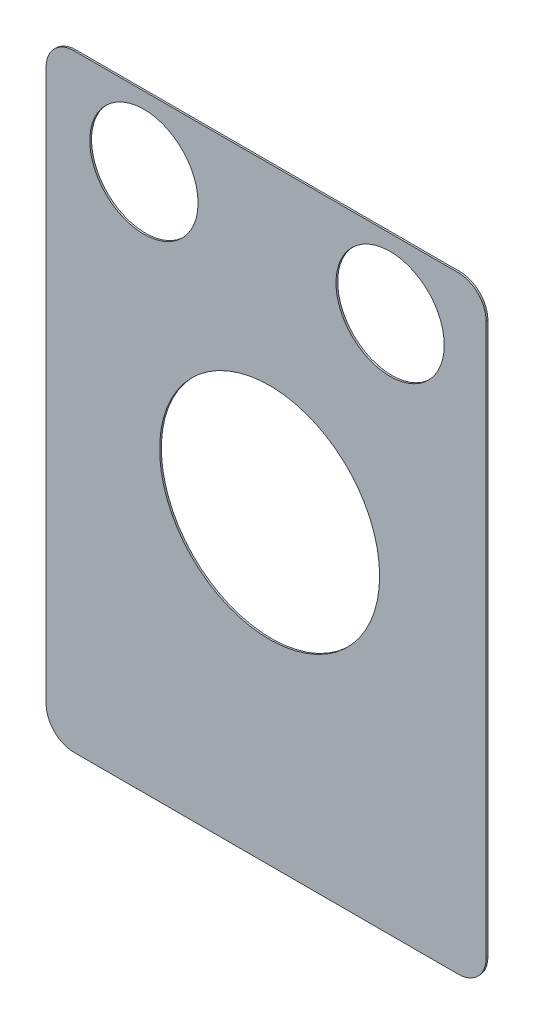
ISO-10303-21;
HEADER;
FILE_DESCRIPTION(('STEP AP214'),'2;1');
FILE_NAME('part.step','',(''),(''),'','','');
FILE_SCHEMA(('AUTOMOTIVE_DESIGN { 1 0 10303 214 1 1 1 1 }'));
ENDSEC;
DATA;
#1=APPLICATION_CONTEXT('core data for automotive mechanical design processes');
#2=APPLICATION_PROTOCOL_DEFINITION('international standard','automotive_design',2000,#1);
#3=PRODUCT_CONTEXT('',#1,'mechanical');
#4=PRODUCT('Part','Part','',(#3));
#5=PRODUCT_RELATED_PRODUCT_CATEGORY('part','',(#4));
#6=PRODUCT_DEFINITION_FORMATION('','',#4);
#7=PRODUCT_DEFINITION_CONTEXT('part definition',#1,'design');
#8=PRODUCT_DEFINITION('design','',#6,#7);
#9=PRODUCT_DEFINITION_SHAPE('','',#8);
#10=(LENGTH_UNIT() NAMED_UNIT(*) SI_UNIT(.MILLI.,.METRE.));
#11=(NAMED_UNIT(*) PLANE_ANGLE_UNIT() SI_UNIT($,.RADIAN.));
#12=(NAMED_UNIT(*) SI_UNIT($,.STERADIAN.) SOLID_ANGLE_UNIT());
#13=UNCERTAINTY_MEASURE_WITH_UNIT(LENGTH_MEASURE(1.E-05),#10,'distance_accuracy_value','');
#14=(GEOMETRIC_REPRESENTATION_CONTEXT(3) GLOBAL_UNCERTAINTY_ASSIGNED_CONTEXT((#13)) GLOBAL_UNIT_ASSIGNED_CONTEXT((#10,
#11,#12)) REPRESENTATION_CONTEXT('',''));
#15=CARTESIAN_POINT('',(0.,0.,0.));
#16=DIRECTION('',(0.,0.,1.));
#17=DIRECTION('',(1.,0.,0.));
#18=AXIS2_PLACEMENT_3D('',#15,#16,#17);
#19=CARTESIAN_POINT('',(-27.94,-40.132,-0.254));
#20=DIRECTION('',(0.,0.,1.));
#21=DIRECTION('',(1.,0.,0.));
#22=AXIS2_PLACEMENT_3D('',#19,#20,#21);
#23=CYLINDRICAL_SURFACE('',#22,4.064);
#24=CARTESIAN_POINT('',(-27.94,-40.132,0.));
#25=DIRECTION('',(0.,0.,1.));
#26=DIRECTION('',(1.,0.,0.));
#27=AXIS2_PLACEMENT_3D('',#24,#25,#26);
#28=CIRCLE('',#27,4.064);
#29=CARTESIAN_POINT('',(-32.004,-40.132,0.));
#30=VERTEX_POINT('',#29);
#31=CARTESIAN_POINT('',(-27.94,-44.196,0.));
#32=VERTEX_POINT('',#31);
#33=EDGE_CURVE('E135',#30,#32,#28,.T.);
#34=ORIENTED_EDGE('',*,*,#33,.F.);
#35=DIRECTION('',(0.,0.,1.));
#36=VECTOR('',#35,1.);
#37=CARTESIAN_POINT('',(-32.004,-40.132,-0.254));
#38=LINE('',#37,#36);
#39=CARTESIAN_POINT('',(-32.004,-40.132,-0.254));
#40=VERTEX_POINT('',#39);
#41=EDGE_CURVE('E11',#40,#30,#38,.T.);
#42=ORIENTED_EDGE('',*,*,#41,.F.);
#43=CARTESIAN_POINT('',(-27.94,-40.132,-0.254));
#44=DIRECTION('',(0.,0.,1.));
#45=DIRECTION('',(1.,0.,0.));
#46=AXIS2_PLACEMENT_3D('',#43,#44,#45);
#47=CIRCLE('',#46,4.064);
#48=CARTESIAN_POINT('',(-27.94,-44.196,-0.254));
#49=VERTEX_POINT('',#48);
#50=EDGE_CURVE('E156',#40,#49,#47,.T.);
#51=ORIENTED_EDGE('',*,*,#50,.T.);
#52=DIRECTION('',(0.,0.,1.));
#53=VECTOR('',#52,1.);
#54=CARTESIAN_POINT('',(-27.94,-44.196,-0.254));
#55=LINE('',#54,#53);
#56=EDGE_CURVE('E41',#49,#32,#55,.T.);
#57=ORIENTED_EDGE('',*,*,#56,.T.);
#58=EDGE_LOOP('',(#34,#42,#51,#57));
#59=FACE_BOUND('',#58,.T.);
#60=ADVANCED_FACE('F38',(#59),#23,.T.);
#61=CARTESIAN_POINT('',(-32.004,-40.132,-0.254));
#62=DIRECTION('',(-1.,0.,0.));
#63=DIRECTION('',(0.,0.,1.));
#64=AXIS2_PLACEMENT_3D('',#61,#62,#63);
#65=PLANE('',#64);
#66=DIRECTION('',(0.,-1.,0.));
#67=VECTOR('',#66,1.);
#68=CARTESIAN_POINT('',(-32.004,-40.132,0.));
#69=LINE('',#68,#67);
#70=CARTESIAN_POINT('',(-32.004,40.132,0.));
#71=VERTEX_POINT('',#70);
#72=EDGE_CURVE('E154',#71,#30,#69,.T.);
#73=ORIENTED_EDGE('',*,*,#72,.F.);
#74=DIRECTION('',(0.,0.,1.));
#75=VECTOR('',#74,1.);
#76=CARTESIAN_POINT('',(-32.004,40.132,-0.254));
#77=LINE('',#76,#75);
#78=CARTESIAN_POINT('',(-32.004,40.132,-0.254));
#79=VERTEX_POINT('',#78);
#80=EDGE_CURVE('E47',#79,#71,#77,.T.);
#81=ORIENTED_EDGE('',*,*,#80,.F.);
#82=DIRECTION('',(0.,-1.,0.));
#83=VECTOR('',#82,1.);
#84=CARTESIAN_POINT('',(-32.004,-40.132,-0.254));
#85=LINE('',#84,#83);
#86=EDGE_CURVE('E125',#79,#40,#85,.T.);
#87=ORIENTED_EDGE('',*,*,#86,.T.);
#88=ORIENTED_EDGE('',*,*,#41,.T.);
#89=EDGE_LOOP('',(#73,#81,#87,#88));
#90=FACE_BOUND('',#89,.T.);
#91=ADVANCED_FACE('F168',(#90),#65,.T.);
#92=CARTESIAN_POINT('',(-27.94,40.132,-0.254));
#93=DIRECTION('',(0.,0.,1.));
#94=DIRECTION('',(1.,0.,0.));
#95=AXIS2_PLACEMENT_3D('',#92,#93,#94);
#96=CYLINDRICAL_SURFACE('',#95,4.064);
#97=CARTESIAN_POINT('',(-27.94,40.132,0.));
#98=DIRECTION('',(0.,0.,1.));
#99=DIRECTION('',(1.,0.,0.));
#100=AXIS2_PLACEMENT_3D('',#97,#98,#99);
#101=CIRCLE('',#100,4.064);
#102=CARTESIAN_POINT('',(-27.94,44.196,0.));
#103=VERTEX_POINT('',#102);
#104=EDGE_CURVE('E112',#103,#71,#101,.T.);
#105=ORIENTED_EDGE('',*,*,#104,.F.);
#106=DIRECTION('',(0.,0.,1.));
#107=VECTOR('',#106,1.);
#108=CARTESIAN_POINT('',(-27.94,44.196,-0.254));
#109=LINE('',#108,#107);
#110=CARTESIAN_POINT('',(-27.94,44.196,-0.254));
#111=VERTEX_POINT('',#110);
#112=EDGE_CURVE('E107',#111,#103,#109,.T.);
#113=ORIENTED_EDGE('',*,*,#112,.F.);
#114=CARTESIAN_POINT('',(-27.94,40.132,-0.254));
#115=DIRECTION('',(0.,0.,1.));
#116=DIRECTION('',(1.,0.,0.));
#117=AXIS2_PLACEMENT_3D('',#114,#115,#116);
#118=CIRCLE('',#117,4.064);
#119=EDGE_CURVE('E110',#111,#79,#118,.T.);
#120=ORIENTED_EDGE('',*,*,#119,.T.);
#121=ORIENTED_EDGE('',*,*,#80,.T.);
#122=EDGE_LOOP('',(#105,#113,#120,#121));
#123=FACE_BOUND('',#122,.T.);
#124=ADVANCED_FACE('F109',(#123),#96,.T.);
#125=CARTESIAN_POINT('',(-27.94,44.196,-0.254));
#126=DIRECTION('',(0.,1.,0.));
#127=DIRECTION('',(0.,0.,1.));
#128=AXIS2_PLACEMENT_3D('',#125,#126,#127);
#129=PLANE('',#128);
#130=DIRECTION('',(-1.,0.,0.));
#131=VECTOR('',#130,1.);
#132=CARTESIAN_POINT('',(-27.94,44.196,0.));
#133=LINE('',#132,#131);
#134=CARTESIAN_POINT('',(27.94,44.196,0.));
#135=VERTEX_POINT('',#134);
#136=EDGE_CURVE('E151',#135,#103,#133,.T.);
#137=ORIENTED_EDGE('',*,*,#136,.F.);
#138=DIRECTION('',(0.,0.,1.));
#139=VECTOR('',#138,1.);
#140=CARTESIAN_POINT('',(27.94,44.196,-0.254));
#141=LINE('',#140,#139);
#142=CARTESIAN_POINT('',(27.94,44.196,-0.254));
#143=VERTEX_POINT('',#142);
#144=EDGE_CURVE('E117',#143,#135,#141,.T.);
#145=ORIENTED_EDGE('',*,*,#144,.F.);
#146=DIRECTION('',(-1.,0.,0.));
#147=VECTOR('',#146,1.);
#148=CARTESIAN_POINT('',(-27.94,44.196,-0.254));
#149=LINE('',#148,#147);
#150=EDGE_CURVE('E123',#143,#111,#149,.T.);
#151=ORIENTED_EDGE('',*,*,#150,.T.);
#152=ORIENTED_EDGE('',*,*,#112,.T.);
#153=EDGE_LOOP('',(#137,#145,#151,#152));
#154=FACE_BOUND('',#153,.T.);
#155=ADVANCED_FACE('F127',(#154),#129,.T.);
#156=CARTESIAN_POINT('',(27.94,40.132,-0.254));
#157=DIRECTION('',(0.,0.,1.));
#158=DIRECTION('',(1.,0.,0.));
#159=AXIS2_PLACEMENT_3D('',#156,#157,#158);
#160=CYLINDRICAL_SURFACE('',#159,4.064);
#161=CARTESIAN_POINT('',(27.94,40.132,0.));
#162=DIRECTION('',(0.,0.,1.));
#163=DIRECTION('',(1.,0.,0.));
#164=AXIS2_PLACEMENT_3D('',#161,#162,#163);
#165=CIRCLE('',#164,4.064);
#166=CARTESIAN_POINT('',(32.004,40.132,0.));
#167=VERTEX_POINT('',#166);
#168=EDGE_CURVE('E148',#167,#135,#165,.T.);
#169=ORIENTED_EDGE('',*,*,#168,.F.);
#170=DIRECTION('',(0.,0.,1.));
#171=VECTOR('',#170,1.);
#172=CARTESIAN_POINT('',(32.004,40.132,-0.254));
#173=LINE('',#172,#171);
#174=CARTESIAN_POINT('',(32.004,40.132,-0.254));
#175=VERTEX_POINT('',#174);
#176=EDGE_CURVE('E160',#175,#167,#173,.T.);
#177=ORIENTED_EDGE('',*,*,#176,.F.);
#178=CARTESIAN_POINT('',(27.94,40.132,-0.254));
#179=DIRECTION('',(0.,0.,1.));
#180=DIRECTION('',(1.,0.,0.));
#181=AXIS2_PLACEMENT_3D('',#178,#179,#180);
#182=CIRCLE('',#181,4.064);
#183=EDGE_CURVE('E128',#175,#143,#182,.T.);
#184=ORIENTED_EDGE('',*,*,#183,.T.);
#185=ORIENTED_EDGE('',*,*,#144,.T.);
#186=EDGE_LOOP('',(#169,#177,#184,#185));
#187=FACE_BOUND('',#186,.T.);
#188=ADVANCED_FACE('F181',(#187),#160,.T.);
#189=CARTESIAN_POINT('',(32.004,-40.132,-0.254));
#190=DIRECTION('',(1.,0.,0.));
#191=DIRECTION('',(0.,0.,-1.));
#192=AXIS2_PLACEMENT_3D('',#189,#190,#191);
#193=PLANE('',#192);
#194=DIRECTION('',(0.,1.,0.));
#195=VECTOR('',#194,1.);
#196=CARTESIAN_POINT('',(32.004,-40.132,0.));
#197=LINE('',#196,#195);
#198=CARTESIAN_POINT('',(32.004,-40.132,0.));
#199=VERTEX_POINT('',#198);
#200=EDGE_CURVE('E145',#199,#167,#197,.T.);
#201=ORIENTED_EDGE('',*,*,#200,.F.);
#202=DIRECTION('',(0.,0.,1.));
#203=VECTOR('',#202,1.);
#204=CARTESIAN_POINT('',(32.004,-40.132,-0.254));
#205=LINE('',#204,#203);
#206=CARTESIAN_POINT('',(32.004,-40.132,-0.254));
#207=VERTEX_POINT('',#206);
#208=EDGE_CURVE('E162',#207,#199,#205,.T.);
#209=ORIENTED_EDGE('',*,*,#208,.F.);
#210=DIRECTION('',(0.,1.,0.));
#211=VECTOR('',#210,1.);
#212=CARTESIAN_POINT('',(32.004,-40.132,-0.254));
#213=LINE('',#212,#211);
#214=EDGE_CURVE('E130',#207,#175,#213,.T.);
#215=ORIENTED_EDGE('',*,*,#214,.T.);
#216=ORIENTED_EDGE('',*,*,#176,.T.);
#217=EDGE_LOOP('',(#201,#209,#215,#216));
#218=FACE_BOUND('',#217,.T.);
#219=ADVANCED_FACE('F184',(#218),#193,.T.);
#220=CARTESIAN_POINT('',(27.94,-40.132,-0.254));
#221=DIRECTION('',(0.,0.,1.));
#222=DIRECTION('',(1.,0.,0.));
#223=AXIS2_PLACEMENT_3D('',#220,#221,#222);
#224=CYLINDRICAL_SURFACE('',#223,4.064);
#225=CARTESIAN_POINT('',(27.94,-40.132,0.));
#226=DIRECTION('',(0.,0.,1.));
#227=DIRECTION('',(1.,0.,0.));
#228=AXIS2_PLACEMENT_3D('',#225,#226,#227);
#229=CIRCLE('',#228,4.064);
#230=CARTESIAN_POINT('',(27.94,-44.196,0.));
#231=VERTEX_POINT('',#230);
#232=EDGE_CURVE('E142',#231,#199,#229,.T.);
#233=ORIENTED_EDGE('',*,*,#232,.F.);
#234=DIRECTION('',(0.,0.,1.));
#235=VECTOR('',#234,1.);
#236=CARTESIAN_POINT('',(27.94,-44.196,-0.254));
#237=LINE('',#236,#235);
#238=CARTESIAN_POINT('',(27.94,-44.196,-0.254));
#239=VERTEX_POINT('',#238);
#240=EDGE_CURVE('E163',#239,#231,#237,.T.);
#241=ORIENTED_EDGE('',*,*,#240,.F.);
#242=CARTESIAN_POINT('',(27.94,-40.132,-0.254));
#243=DIRECTION('',(0.,0.,1.));
#244=DIRECTION('',(1.,0.,0.));
#245=AXIS2_PLACEMENT_3D('',#242,#243,#244);
#246=CIRCLE('',#245,4.064);
#247=EDGE_CURVE('E240',#239,#207,#246,.T.);
#248=ORIENTED_EDGE('',*,*,#247,.T.);
#249=ORIENTED_EDGE('',*,*,#208,.T.);
#250=EDGE_LOOP('',(#233,#241,#248,#249));
#251=FACE_BOUND('',#250,.T.);
#252=ADVANCED_FACE('F188',(#251),#224,.T.);
#253=CARTESIAN_POINT('',(-27.94,-44.196,-0.254));
#254=DIRECTION('',(0.,-1.,0.));
#255=DIRECTION('',(0.,0.,-1.));
#256=AXIS2_PLACEMENT_3D('',#253,#254,#255);
#257=PLANE('',#256);
#258=DIRECTION('',(1.,0.,0.));
#259=VECTOR('',#258,1.);
#260=CARTESIAN_POINT('',(-27.94,-44.196,0.));
#261=LINE('',#260,#259);
#262=EDGE_CURVE('E138',#32,#231,#261,.T.);
#263=ORIENTED_EDGE('',*,*,#262,.F.);
#264=ORIENTED_EDGE('',*,*,#56,.F.);
#265=DIRECTION('',(1.,0.,0.));
#266=VECTOR('',#265,1.);
#267=CARTESIAN_POINT('',(-27.94,-44.196,-0.254));
#268=LINE('',#267,#266);
#269=EDGE_CURVE('E238',#49,#239,#268,.T.);
#270=ORIENTED_EDGE('',*,*,#269,.T.);
#271=ORIENTED_EDGE('',*,*,#240,.T.);
#272=EDGE_LOOP('',(#263,#264,#270,#271));
#273=FACE_BOUND('',#272,.T.);
#274=ADVANCED_FACE('F165',(#273),#257,.T.);
#275=CARTESIAN_POINT('',(-27.94,-40.132,-0.254));
#276=DIRECTION('',(0.,0.,1.));
#277=DIRECTION('',(1.,0.,0.));
#278=AXIS2_PLACEMENT_3D('',#275,#276,#277);
#279=PLANE('',#278);
#280=CARTESIAN_POINT('',(0.508000000000008,0.253999999999997,-0.254));
#281=DIRECTION('',(0.,0.,1.));
#282=DIRECTION('',(1.,0.,0.));
#283=AXIS2_PLACEMENT_3D('',#280,#281,#282);
#284=CIRCLE('',#283,16.002);
#285=CARTESIAN_POINT('',(16.51,0.253999999999997,-0.254));
#286=VERTEX_POINT('',#285);
#287=EDGE_CURVE('E219',#286,#286,#284,.T.);
#288=ORIENTED_EDGE('',*,*,#287,.T.);
#289=EDGE_LOOP('',(#288));
#290=FACE_BOUND('',#289,.T.);
#291=CARTESIAN_POINT('',(18.034,34.036,-0.254));
#292=DIRECTION('',(0.,0.,1.));
#293=DIRECTION('',(1.,0.,0.));
#294=AXIS2_PLACEMENT_3D('',#291,#292,#293);
#295=CIRCLE('',#294,7.874);
#296=CARTESIAN_POINT('',(25.908,34.036,-0.254));
#297=VERTEX_POINT('',#296);
#298=EDGE_CURVE('E139',#297,#297,#295,.T.);
#299=ORIENTED_EDGE('',*,*,#298,.T.);
#300=EDGE_LOOP('',(#299));
#301=FACE_BOUND('',#300,.T.);
#302=CARTESIAN_POINT('',(-17.78,34.036,-0.254));
#303=DIRECTION('',(0.,0.,1.));
#304=DIRECTION('',(1.,0.,0.));
#305=AXIS2_PLACEMENT_3D('',#302,#303,#304);
#306=CIRCLE('',#305,7.874);
#307=CARTESIAN_POINT('',(-9.906,34.036,-0.254));
#308=VERTEX_POINT('',#307);
#309=EDGE_CURVE('E224',#308,#308,#306,.T.);
#310=ORIENTED_EDGE('',*,*,#309,.T.);
#311=EDGE_LOOP('',(#310));
#312=FACE_BOUND('',#311,.T.);
#313=ORIENTED_EDGE('',*,*,#50,.F.);
#314=ORIENTED_EDGE('',*,*,#86,.F.);
#315=ORIENTED_EDGE('',*,*,#119,.F.);
#316=ORIENTED_EDGE('',*,*,#150,.F.);
#317=ORIENTED_EDGE('',*,*,#183,.F.);
#318=ORIENTED_EDGE('',*,*,#214,.F.);
#319=ORIENTED_EDGE('',*,*,#247,.F.);
#320=ORIENTED_EDGE('',*,*,#269,.F.);
#321=EDGE_LOOP('',(#313,#314,#315,#316,#317,#318,#319,#320));
#322=FACE_BOUND('',#321,.T.);
#323=ADVANCED_FACE('F121',(#290,#301,#312,#322),#279,.F.);
#324=CARTESIAN_POINT('',(-27.94,-40.132,0.));
#325=DIRECTION('',(0.,0.,1.));
#326=DIRECTION('',(1.,0.,0.));
#327=AXIS2_PLACEMENT_3D('',#324,#325,#326);
#328=PLANE('',#327);
#329=CARTESIAN_POINT('',(0.508000000000008,0.253999999999997,0.));
#330=DIRECTION('',(0.,0.,1.));
#331=DIRECTION('',(1.,0.,0.));
#332=AXIS2_PLACEMENT_3D('',#329,#330,#331);
#333=CIRCLE('',#332,16.002);
#334=CARTESIAN_POINT('',(16.51,0.253999999999997,0.));
#335=VERTEX_POINT('',#334);
#336=EDGE_CURVE('E222',#335,#335,#333,.T.);
#337=ORIENTED_EDGE('',*,*,#336,.F.);
#338=EDGE_LOOP('',(#337));
#339=FACE_BOUND('',#338,.T.);
#340=CARTESIAN_POINT('',(18.034,34.036,0.));
#341=DIRECTION('',(0.,0.,1.));
#342=DIRECTION('',(1.,0.,0.));
#343=AXIS2_PLACEMENT_3D('',#340,#341,#342);
#344=CIRCLE('',#343,7.874);
#345=CARTESIAN_POINT('',(25.908,34.036,0.));
#346=VERTEX_POINT('',#345);
#347=EDGE_CURVE('E229',#346,#346,#344,.T.);
#348=ORIENTED_EDGE('',*,*,#347,.F.);
#349=EDGE_LOOP('',(#348));
#350=FACE_BOUND('',#349,.T.);
#351=CARTESIAN_POINT('',(-17.78,34.036,0.));
#352=DIRECTION('',(0.,0.,1.));
#353=DIRECTION('',(1.,0.,0.));
#354=AXIS2_PLACEMENT_3D('',#351,#352,#353);
#355=CIRCLE('',#354,7.874);
#356=CARTESIAN_POINT('',(-9.906,34.036,0.));
#357=VERTEX_POINT('',#356);
#358=EDGE_CURVE('E232',#357,#357,#355,.T.);
#359=ORIENTED_EDGE('',*,*,#358,.F.);
#360=EDGE_LOOP('',(#359));
#361=FACE_BOUND('',#360,.T.);
#362=ORIENTED_EDGE('',*,*,#33,.T.);
#363=ORIENTED_EDGE('',*,*,#262,.T.);
#364=ORIENTED_EDGE('',*,*,#232,.T.);
#365=ORIENTED_EDGE('',*,*,#200,.T.);
#366=ORIENTED_EDGE('',*,*,#168,.T.);
#367=ORIENTED_EDGE('',*,*,#136,.T.);
#368=ORIENTED_EDGE('',*,*,#104,.T.);
#369=ORIENTED_EDGE('',*,*,#72,.T.);
#370=EDGE_LOOP('',(#362,#363,#364,#365,#366,#367,#368,#369));
#371=FACE_BOUND('',#370,.T.);
#372=ADVANCED_FACE('F167',(#339,#350,#361,#371),#328,.T.);
#373=CARTESIAN_POINT('',(-17.78,34.036,-0.254));
#374=DIRECTION('',(0.,0.,1.));
#375=DIRECTION('',(1.,0.,0.));
#376=AXIS2_PLACEMENT_3D('',#373,#374,#375);
#377=CYLINDRICAL_SURFACE('',#376,7.874);
#378=ORIENTED_EDGE('',*,*,#309,.F.);
#379=EDGE_LOOP('',(#378));
#380=FACE_BOUND('',#379,.T.);
#381=ORIENTED_EDGE('',*,*,#358,.T.);
#382=EDGE_LOOP('',(#381));
#383=FACE_BOUND('',#382,.T.);
#384=ADVANCED_FACE('F200',(#380,#383),#377,.F.);
#385=CARTESIAN_POINT('',(18.034,34.036,-0.254));
#386=DIRECTION('',(0.,0.,1.));
#387=DIRECTION('',(1.,0.,0.));
#388=AXIS2_PLACEMENT_3D('',#385,#386,#387);
#389=CYLINDRICAL_SURFACE('',#388,7.874);
#390=ORIENTED_EDGE('',*,*,#298,.F.);
#391=EDGE_LOOP('',(#390));
#392=FACE_BOUND('',#391,.T.);
#393=ORIENTED_EDGE('',*,*,#347,.T.);
#394=EDGE_LOOP('',(#393));
#395=FACE_BOUND('',#394,.T.);
#396=ADVANCED_FACE('F207',(#392,#395),#389,.F.);
#397=CARTESIAN_POINT('',(0.508000000000008,0.253999999999997,-0.254));
#398=DIRECTION('',(0.,0.,1.));
#399=DIRECTION('',(1.,0.,0.));
#400=AXIS2_PLACEMENT_3D('',#397,#398,#399);
#401=CYLINDRICAL_SURFACE('',#400,16.002);
#402=ORIENTED_EDGE('',*,*,#287,.F.);
#403=EDGE_LOOP('',(#402));
#404=FACE_BOUND('',#403,.T.);
#405=ORIENTED_EDGE('',*,*,#336,.T.);
#406=EDGE_LOOP('',(#405));
#407=FACE_BOUND('',#406,.T.);
#408=ADVANCED_FACE('F211',(#404,#407),#401,.F.);
#409=CLOSED_SHELL('',(#60,#91,#124,#155,#188,#219,#252,#274,#323,#372,#384,#396,#408));
#410=MANIFOLD_SOLID_BREP('B2',#409);
#411=ADVANCED_BREP_SHAPE_REPRESENTATION('',(#18,#410),#14);
#412=SHAPE_DEFINITION_REPRESENTATION(#9,#411);
ENDSEC;
END-ISO-10303-21;
